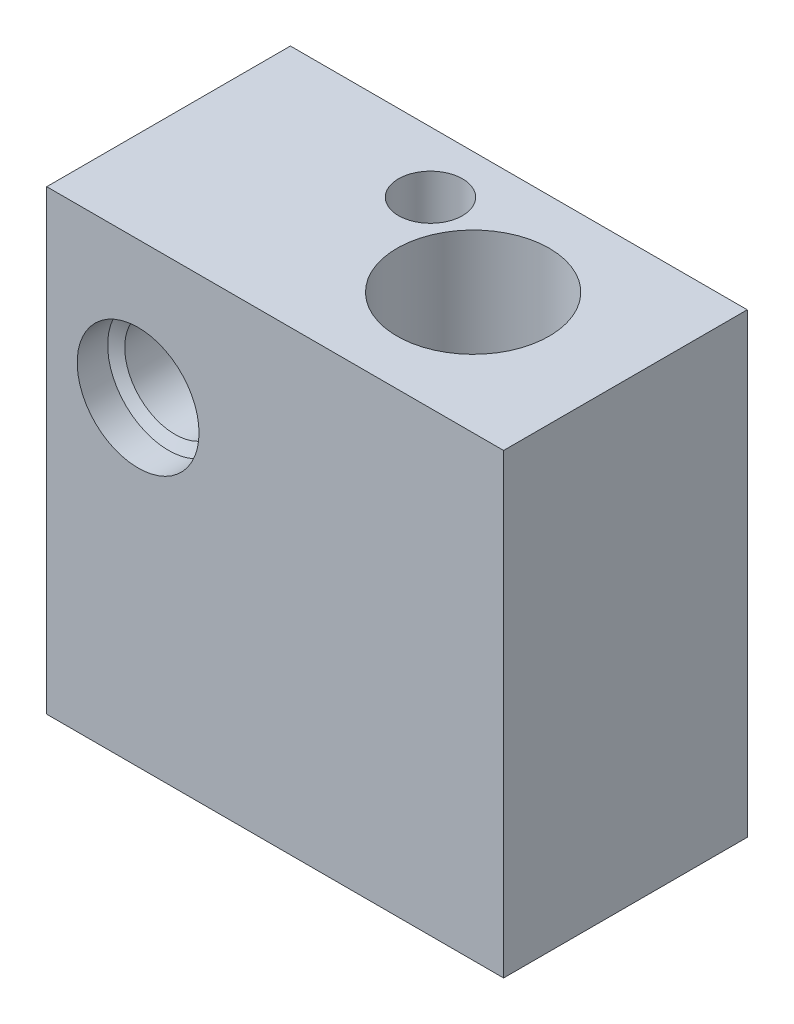
ISO-10303-21;
HEADER;
FILE_DESCRIPTION(('STEP AP214'),'2;1');
FILE_NAME('part.step','',(''),(''),'','','');
FILE_SCHEMA(('AUTOMOTIVE_DESIGN { 1 0 10303 214 1 1 1 1 }'));
ENDSEC;
DATA;
#1=APPLICATION_CONTEXT('core data for automotive mechanical design processes');
#2=APPLICATION_PROTOCOL_DEFINITION('international standard','automotive_design',2000,#1);
#3=PRODUCT_CONTEXT('',#1,'mechanical');
#4=PRODUCT('Part','Part','',(#3));
#5=PRODUCT_RELATED_PRODUCT_CATEGORY('part','',(#4));
#6=PRODUCT_DEFINITION_FORMATION('','',#4);
#7=PRODUCT_DEFINITION_CONTEXT('part definition',#1,'design');
#8=PRODUCT_DEFINITION('design','',#6,#7);
#9=PRODUCT_DEFINITION_SHAPE('','',#8);
#10=(LENGTH_UNIT() NAMED_UNIT(*) SI_UNIT(.MILLI.,.METRE.));
#11=(NAMED_UNIT(*) PLANE_ANGLE_UNIT() SI_UNIT($,.RADIAN.));
#12=(NAMED_UNIT(*) SI_UNIT($,.STERADIAN.) SOLID_ANGLE_UNIT());
#13=UNCERTAINTY_MEASURE_WITH_UNIT(LENGTH_MEASURE(1.E-05),#10,'distance_accuracy_value','');
#14=(GEOMETRIC_REPRESENTATION_CONTEXT(3) GLOBAL_UNCERTAINTY_ASSIGNED_CONTEXT((#13)) GLOBAL_UNIT_ASSIGNED_CONTEXT((#10,
#11,#12)) REPRESENTATION_CONTEXT('',''));
#15=CARTESIAN_POINT('',(0.,0.,0.));
#16=DIRECTION('',(0.,0.,1.));
#17=DIRECTION('',(1.,0.,0.));
#18=AXIS2_PLACEMENT_3D('',#15,#16,#17);
#19=CARTESIAN_POINT('',(0.,0.,8.));
#20=DIRECTION('',(0.,0.,1.));
#21=DIRECTION('',(1.,0.,0.));
#22=AXIS2_PLACEMENT_3D('',#19,#20,#21);
#23=PLANE('',#22);
#24=CARTESIAN_POINT('',(0.,0.,8.));
#25=DIRECTION('',(0.,0.,1.));
#26=DIRECTION('',(1.,0.,0.));
#27=AXIS2_PLACEMENT_3D('',#24,#25,#26);
#28=CIRCLE('',#27,1.99999999999999);
#29=CARTESIAN_POINT('',(1.99999999999999,0.,8.));
#30=VERTEX_POINT('',#29);
#31=EDGE_CURVE('E142',#30,#30,#28,.T.);
#32=ORIENTED_EDGE('',*,*,#31,.F.);
#33=EDGE_LOOP('',(#32));
#34=FACE_BOUND('',#33,.T.);
#35=DIRECTION('',(0.,-1.,0.));
#36=VECTOR('',#35,1.);
#37=CARTESIAN_POINT('',(-3.,4.5,8.));
#38=LINE('',#37,#36);
#39=CARTESIAN_POINT('',(-3.,4.5,8.));
#40=VERTEX_POINT('',#39);
#41=CARTESIAN_POINT('',(-3.,-10.5,8.));
#42=VERTEX_POINT('',#41);
#43=EDGE_CURVE('E93',#40,#42,#38,.T.);
#44=ORIENTED_EDGE('',*,*,#43,.T.);
#45=DIRECTION('',(1.,0.,0.));
#46=VECTOR('',#45,1.);
#47=CARTESIAN_POINT('',(-3.,-10.5,8.));
#48=LINE('',#47,#46);
#49=CARTESIAN_POINT('',(12.,-10.5,8.));
#50=VERTEX_POINT('',#49);
#51=EDGE_CURVE('E89',#42,#50,#48,.T.);
#52=ORIENTED_EDGE('',*,*,#51,.T.);
#53=DIRECTION('',(0.,1.,0.));
#54=VECTOR('',#53,1.);
#55=CARTESIAN_POINT('',(12.,4.5,8.));
#56=LINE('',#55,#54);
#57=CARTESIAN_POINT('',(12.,4.5,8.));
#58=VERTEX_POINT('',#57);
#59=EDGE_CURVE('E91',#50,#58,#56,.T.);
#60=ORIENTED_EDGE('',*,*,#59,.T.);
#61=DIRECTION('',(-1.,0.,0.));
#62=VECTOR('',#61,1.);
#63=CARTESIAN_POINT('',(-3.,4.5,8.));
#64=LINE('',#63,#62);
#65=EDGE_CURVE('E59',#58,#40,#64,.T.);
#66=ORIENTED_EDGE('',*,*,#65,.T.);
#67=EDGE_LOOP('',(#44,#52,#60,#66));
#68=FACE_BOUND('',#67,.T.);
#69=ADVANCED_FACE('F41',(#34,#68),#23,.T.);
#70=CARTESIAN_POINT('',(0.,0.,0.));
#71=DIRECTION('',(0.,0.,1.));
#72=DIRECTION('',(1.,0.,0.));
#73=AXIS2_PLACEMENT_3D('',#70,#71,#72);
#74=PLANE('',#73);
#75=DIRECTION('',(0.,-1.,0.));
#76=VECTOR('',#75,1.);
#77=CARTESIAN_POINT('',(-3.,4.5,0.));
#78=LINE('',#77,#76);
#79=CARTESIAN_POINT('',(-3.,4.5,0.));
#80=VERTEX_POINT('',#79);
#81=CARTESIAN_POINT('',(-3.,-10.5,0.));
#82=VERTEX_POINT('',#81);
#83=EDGE_CURVE('E107',#80,#82,#78,.T.);
#84=ORIENTED_EDGE('',*,*,#83,.F.);
#85=DIRECTION('',(-1.,0.,0.));
#86=VECTOR('',#85,1.);
#87=CARTESIAN_POINT('',(-3.,4.5,0.));
#88=LINE('',#87,#86);
#89=CARTESIAN_POINT('',(12.,4.5,0.));
#90=VERTEX_POINT('',#89);
#91=EDGE_CURVE('E82',#90,#80,#88,.T.);
#92=ORIENTED_EDGE('',*,*,#91,.F.);
#93=DIRECTION('',(0.,1.,0.));
#94=VECTOR('',#93,1.);
#95=CARTESIAN_POINT('',(12.,4.5,0.));
#96=LINE('',#95,#94);
#97=CARTESIAN_POINT('',(12.,-10.5,0.));
#98=VERTEX_POINT('',#97);
#99=EDGE_CURVE('E76',#98,#90,#96,.T.);
#100=ORIENTED_EDGE('',*,*,#99,.F.);
#101=DIRECTION('',(1.,0.,0.));
#102=VECTOR('',#101,1.);
#103=CARTESIAN_POINT('',(-3.,-10.5,0.));
#104=LINE('',#103,#102);
#105=EDGE_CURVE('E97',#82,#98,#104,.T.);
#106=ORIENTED_EDGE('',*,*,#105,.F.);
#107=EDGE_LOOP('',(#84,#92,#100,#106));
#108=FACE_BOUND('',#107,.T.);
#109=CARTESIAN_POINT('',(0.,0.,0.));
#110=DIRECTION('',(0.,0.,1.));
#111=DIRECTION('',(1.,0.,0.));
#112=AXIS2_PLACEMENT_3D('',#109,#110,#111);
#113=CIRCLE('',#112,1.65);
#114=CARTESIAN_POINT('',(1.65,0.,0.));
#115=VERTEX_POINT('',#114);
#116=EDGE_CURVE('E110',#115,#115,#113,.T.);
#117=ORIENTED_EDGE('',*,*,#116,.T.);
#118=EDGE_LOOP('',(#117));
#119=FACE_BOUND('',#118,.T.);
#120=ADVANCED_FACE('F119',(#108,#119),#74,.F.);
#121=CARTESIAN_POINT('',(-3.,4.5,8.));
#122=DIRECTION('',(1.,0.,0.));
#123=DIRECTION('',(0.,1.,0.));
#124=AXIS2_PLACEMENT_3D('',#121,#122,#123);
#125=PLANE('',#124);
#126=ORIENTED_EDGE('',*,*,#83,.T.);
#127=DIRECTION('',(0.,0.,-1.));
#128=VECTOR('',#127,1.);
#129=CARTESIAN_POINT('',(-3.,-10.5,8.));
#130=LINE('',#129,#128);
#131=EDGE_CURVE('E11',#42,#82,#130,.T.);
#132=ORIENTED_EDGE('',*,*,#131,.F.);
#133=ORIENTED_EDGE('',*,*,#43,.F.);
#134=DIRECTION('',(0.,0.,-1.));
#135=VECTOR('',#134,1.);
#136=CARTESIAN_POINT('',(-3.,4.5,8.));
#137=LINE('',#136,#135);
#138=EDGE_CURVE('E103',#40,#80,#137,.T.);
#139=ORIENTED_EDGE('',*,*,#138,.T.);
#140=EDGE_LOOP('',(#126,#132,#133,#139));
#141=FACE_BOUND('',#140,.T.);
#142=ADVANCED_FACE('F43',(#141),#125,.F.);
#143=CARTESIAN_POINT('',(-3.,-10.5,8.));
#144=DIRECTION('',(0.,1.,0.));
#145=DIRECTION('',(0.,0.,1.));
#146=AXIS2_PLACEMENT_3D('',#143,#144,#145);
#147=PLANE('',#146);
#148=CARTESIAN_POINT('',(3.6,-10.5,2.));
#149=DIRECTION('',(0.,-1.,0.));
#150=DIRECTION('',(0.,0.,-1.));
#151=AXIS2_PLACEMENT_3D('',#148,#149,#150);
#152=CIRCLE('',#151,1.05);
#153=CARTESIAN_POINT('',(3.6,-10.5,0.95));
#154=VERTEX_POINT('',#153);
#155=EDGE_CURVE('E133',#154,#154,#152,.T.);
#156=ORIENTED_EDGE('',*,*,#155,.F.);
#157=EDGE_LOOP('',(#156));
#158=FACE_BOUND('',#157,.T.);
#159=CARTESIAN_POINT('',(7.,-10.5,4.));
#160=DIRECTION('',(0.,-1.,0.));
#161=DIRECTION('',(0.,0.,-1.));
#162=AXIS2_PLACEMENT_3D('',#159,#160,#161);
#163=CIRCLE('',#162,2.5);
#164=CARTESIAN_POINT('',(7.,-10.5,1.5));
#165=VERTEX_POINT('',#164);
#166=EDGE_CURVE('E126',#165,#165,#163,.T.);
#167=ORIENTED_EDGE('',*,*,#166,.F.);
#168=EDGE_LOOP('',(#167));
#169=FACE_BOUND('',#168,.T.);
#170=ORIENTED_EDGE('',*,*,#105,.T.);
#171=DIRECTION('',(0.,0.,-1.));
#172=VECTOR('',#171,1.);
#173=CARTESIAN_POINT('',(12.,-10.5,8.));
#174=LINE('',#173,#172);
#175=EDGE_CURVE('E51',#50,#98,#174,.T.);
#176=ORIENTED_EDGE('',*,*,#175,.F.);
#177=ORIENTED_EDGE('',*,*,#51,.F.);
#178=ORIENTED_EDGE('',*,*,#131,.T.);
#179=EDGE_LOOP('',(#170,#176,#177,#178));
#180=FACE_BOUND('',#179,.T.);
#181=ADVANCED_FACE('F96',(#158,#169,#180),#147,.F.);
#182=CARTESIAN_POINT('',(12.,4.5,8.));
#183=DIRECTION('',(-1.,0.,0.));
#184=DIRECTION('',(0.,-1.,0.));
#185=AXIS2_PLACEMENT_3D('',#182,#183,#184);
#186=PLANE('',#185);
#187=ORIENTED_EDGE('',*,*,#99,.T.);
#188=DIRECTION('',(0.,0.,-1.));
#189=VECTOR('',#188,1.);
#190=CARTESIAN_POINT('',(12.,4.5,8.));
#191=LINE('',#190,#189);
#192=EDGE_CURVE('E98',#58,#90,#191,.T.);
#193=ORIENTED_EDGE('',*,*,#192,.F.);
#194=ORIENTED_EDGE('',*,*,#59,.F.);
#195=ORIENTED_EDGE('',*,*,#175,.T.);
#196=EDGE_LOOP('',(#187,#193,#194,#195));
#197=FACE_BOUND('',#196,.T.);
#198=ADVANCED_FACE('F100',(#197),#186,.F.);
#199=CARTESIAN_POINT('',(-3.,4.5,8.));
#200=DIRECTION('',(0.,-1.,0.));
#201=DIRECTION('',(0.,0.,-1.));
#202=AXIS2_PLACEMENT_3D('',#199,#200,#201);
#203=PLANE('',#202);
#204=CARTESIAN_POINT('',(3.6,4.5,2.));
#205=DIRECTION('',(0.,-1.,0.));
#206=DIRECTION('',(0.,0.,-1.));
#207=AXIS2_PLACEMENT_3D('',#204,#205,#206);
#208=CIRCLE('',#207,1.05);
#209=CARTESIAN_POINT('',(3.6,4.5,0.95));
#210=VERTEX_POINT('',#209);
#211=EDGE_CURVE('E129',#210,#210,#208,.T.);
#212=ORIENTED_EDGE('',*,*,#211,.T.);
#213=EDGE_LOOP('',(#212));
#214=FACE_BOUND('',#213,.T.);
#215=CARTESIAN_POINT('',(7.,4.5,4.));
#216=DIRECTION('',(0.,-1.,0.));
#217=DIRECTION('',(0.,0.,-1.));
#218=AXIS2_PLACEMENT_3D('',#215,#216,#217);
#219=CIRCLE('',#218,2.5);
#220=CARTESIAN_POINT('',(7.,4.5,1.5));
#221=VERTEX_POINT('',#220);
#222=EDGE_CURVE('E125',#221,#221,#219,.T.);
#223=ORIENTED_EDGE('',*,*,#222,.T.);
#224=EDGE_LOOP('',(#223));
#225=FACE_BOUND('',#224,.T.);
#226=ORIENTED_EDGE('',*,*,#91,.T.);
#227=ORIENTED_EDGE('',*,*,#138,.F.);
#228=ORIENTED_EDGE('',*,*,#65,.F.);
#229=ORIENTED_EDGE('',*,*,#192,.T.);
#230=EDGE_LOOP('',(#226,#227,#228,#229));
#231=FACE_BOUND('',#230,.T.);
#232=ADVANCED_FACE('F116',(#214,#225,#231),#203,.F.);
#233=CARTESIAN_POINT('',(0.,0.,8.));
#234=DIRECTION('',(0.,0.,-1.));
#235=DIRECTION('',(-1.,0.,0.));
#236=AXIS2_PLACEMENT_3D('',#233,#234,#235);
#237=CYLINDRICAL_SURFACE('',#236,1.65);
#238=CARTESIAN_POINT('',(0.,0.,6.78969878334036));
#239=DIRECTION('',(0.,0.,1.));
#240=DIRECTION('',(1.,0.,0.));
#241=AXIS2_PLACEMENT_3D('',#238,#239,#240);
#242=CIRCLE('',#241,1.65);
#243=CARTESIAN_POINT('',(1.65,0.,6.78969878334036));
#244=VERTEX_POINT('',#243);
#245=EDGE_CURVE('E45',#244,#244,#242,.F.);
#246=ORIENTED_EDGE('',*,*,#245,.F.);
#247=EDGE_LOOP('',(#246));
#248=FACE_BOUND('',#247,.T.);
#249=ORIENTED_EDGE('',*,*,#116,.F.);
#250=EDGE_LOOP('',(#249));
#251=FACE_BOUND('',#250,.T.);
#252=ADVANCED_FACE('F155',(#248,#251),#237,.F.);
#253=CARTESIAN_POINT('',(7.,4.5,4.));
#254=DIRECTION('',(0.,-1.,0.));
#255=DIRECTION('',(0.,0.,-1.));
#256=AXIS2_PLACEMENT_3D('',#253,#254,#255);
#257=CYLINDRICAL_SURFACE('',#256,2.5);
#258=ORIENTED_EDGE('',*,*,#222,.F.);
#259=EDGE_LOOP('',(#258));
#260=FACE_BOUND('',#259,.T.);
#261=ORIENTED_EDGE('',*,*,#166,.T.);
#262=EDGE_LOOP('',(#261));
#263=FACE_BOUND('',#262,.T.);
#264=ADVANCED_FACE('F171',(#260,#263),#257,.F.);
#265=CARTESIAN_POINT('',(3.6,4.5,2.));
#266=DIRECTION('',(0.,-1.,0.));
#267=DIRECTION('',(0.,0.,-1.));
#268=AXIS2_PLACEMENT_3D('',#265,#266,#267);
#269=CYLINDRICAL_SURFACE('',#268,1.05);
#270=ORIENTED_EDGE('',*,*,#211,.F.);
#271=EDGE_LOOP('',(#270));
#272=FACE_BOUND('',#271,.T.);
#273=ORIENTED_EDGE('',*,*,#155,.T.);
#274=EDGE_LOOP('',(#273));
#275=FACE_BOUND('',#274,.T.);
#276=ADVANCED_FACE('F173',(#272,#275),#269,.F.);
#277=CARTESIAN_POINT('',(0.,0.,7.));
#278=DIRECTION('',(0.,0.,1.));
#279=DIRECTION('',(1.,0.,0.));
#280=AXIS2_PLACEMENT_3D('',#277,#278,#279);
#281=CONICAL_SURFACE('',#280,1.99999999999999,1.02974425867665);
#282=ORIENTED_EDGE('',*,*,#245,.T.);
#283=EDGE_LOOP('',(#282));
#284=FACE_BOUND('',#283,.T.);
#285=CARTESIAN_POINT('',(0.,0.,7.));
#286=DIRECTION('',(0.,0.,1.));
#287=DIRECTION('',(1.,0.,0.));
#288=AXIS2_PLACEMENT_3D('',#285,#286,#287);
#289=CIRCLE('',#288,1.99999999999999);
#290=CARTESIAN_POINT('',(1.99999999999999,0.,7.));
#291=VERTEX_POINT('',#290);
#292=EDGE_CURVE('E139',#291,#291,#289,.T.);
#293=ORIENTED_EDGE('',*,*,#292,.T.);
#294=EDGE_LOOP('',(#293));
#295=FACE_BOUND('',#294,.T.);
#296=ADVANCED_FACE('F179',(#284,#295),#281,.F.);
#297=CARTESIAN_POINT('',(0.,0.,8.));
#298=DIRECTION('',(0.,0.,1.));
#299=DIRECTION('',(1.,0.,0.));
#300=AXIS2_PLACEMENT_3D('',#297,#298,#299);
#301=CYLINDRICAL_SURFACE('',#300,1.99999999999999);
#302=ORIENTED_EDGE('',*,*,#292,.F.);
#303=EDGE_LOOP('',(#302));
#304=FACE_BOUND('',#303,.T.);
#305=ORIENTED_EDGE('',*,*,#31,.T.);
#306=EDGE_LOOP('',(#305));
#307=FACE_BOUND('',#306,.T.);
#308=ADVANCED_FACE('F146',(#304,#307),#301,.F.);
#309=CLOSED_SHELL('',(#69,#120,#142,#181,#198,#232,#252,#264,#276,#296,#308));
#310=MANIFOLD_SOLID_BREP('B2',#309);
#311=ADVANCED_BREP_SHAPE_REPRESENTATION('',(#18,#310),#14);
#312=SHAPE_DEFINITION_REPRESENTATION(#9,#311);
ENDSEC;
END-ISO-10303-21;
